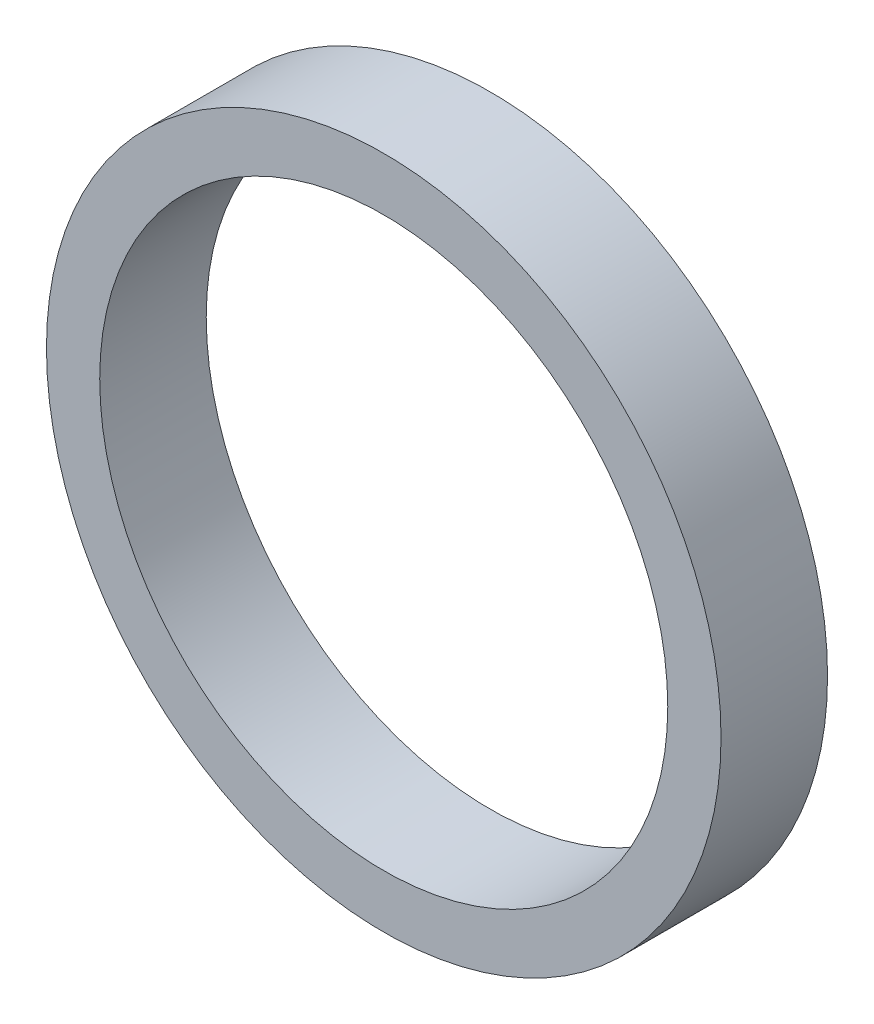
ISO-10303-21;
HEADER;
FILE_DESCRIPTION(('STEP AP214'),'2;1');
FILE_NAME('part.step','',(''),(''),'','','');
FILE_SCHEMA(('AUTOMOTIVE_DESIGN { 1 0 10303 214 1 1 1 1 }'));
ENDSEC;
DATA;
#1=APPLICATION_CONTEXT('core data for automotive mechanical design processes');
#2=APPLICATION_PROTOCOL_DEFINITION('international standard','automotive_design',2000,#1);
#3=PRODUCT_CONTEXT('',#1,'mechanical');
#4=PRODUCT('Part','Part','',(#3));
#5=PRODUCT_RELATED_PRODUCT_CATEGORY('part','',(#4));
#6=PRODUCT_DEFINITION_FORMATION('','',#4);
#7=PRODUCT_DEFINITION_CONTEXT('part definition',#1,'design');
#8=PRODUCT_DEFINITION('design','',#6,#7);
#9=PRODUCT_DEFINITION_SHAPE('','',#8);
#10=(LENGTH_UNIT() NAMED_UNIT(*) SI_UNIT(.MILLI.,.METRE.));
#11=(NAMED_UNIT(*) PLANE_ANGLE_UNIT() SI_UNIT($,.RADIAN.));
#12=(NAMED_UNIT(*) SI_UNIT($,.STERADIAN.) SOLID_ANGLE_UNIT());
#13=UNCERTAINTY_MEASURE_WITH_UNIT(LENGTH_MEASURE(1.E-05),#10,'distance_accuracy_value','');
#14=(GEOMETRIC_REPRESENTATION_CONTEXT(3) GLOBAL_UNCERTAINTY_ASSIGNED_CONTEXT((#13)) GLOBAL_UNIT_ASSIGNED_CONTEXT((#10,
#11,#12)) REPRESENTATION_CONTEXT('',''));
#15=CARTESIAN_POINT('',(0.,0.,0.));
#16=DIRECTION('',(0.,0.,1.));
#17=DIRECTION('',(1.,0.,0.));
#18=AXIS2_PLACEMENT_3D('',#15,#16,#17);
#19=CARTESIAN_POINT('',(0.,0.,3.));
#20=DIRECTION('',(0.,0.,1.));
#21=DIRECTION('',(1.,0.,0.));
#22=AXIS2_PLACEMENT_3D('',#19,#20,#21);
#23=PLANE('',#22);
#24=CARTESIAN_POINT('',(0.,0.,3.));
#25=DIRECTION('',(0.,0.,1.));
#26=DIRECTION('',(1.,0.,0.));
#27=AXIS2_PLACEMENT_3D('',#24,#25,#26);
#28=CIRCLE('',#27,9.5);
#29=CARTESIAN_POINT('',(9.5,0.,3.));
#30=VERTEX_POINT('',#29);
#31=EDGE_CURVE('E10',#30,#30,#28,.T.);
#32=ORIENTED_EDGE('',*,*,#31,.T.);
#33=EDGE_LOOP('',(#32));
#34=FACE_BOUND('',#33,.T.);
#35=CARTESIAN_POINT('',(0.,0.,3.));
#36=DIRECTION('',(0.,0.,1.));
#37=DIRECTION('',(1.,0.,0.));
#38=AXIS2_PLACEMENT_3D('',#35,#36,#37);
#39=CIRCLE('',#38,8.);
#40=CARTESIAN_POINT('',(8.,0.,3.));
#41=VERTEX_POINT('',#40);
#42=EDGE_CURVE('E41',#41,#41,#39,.T.);
#43=ORIENTED_EDGE('',*,*,#42,.F.);
#44=EDGE_LOOP('',(#43));
#45=FACE_BOUND('',#44,.T.);
#46=ADVANCED_FACE('F30',(#34,#45),#23,.T.);
#47=CARTESIAN_POINT('',(0.,0.,0.));
#48=DIRECTION('',(0.,0.,1.));
#49=DIRECTION('',(1.,0.,0.));
#50=AXIS2_PLACEMENT_3D('',#47,#48,#49);
#51=PLANE('',#50);
#52=CARTESIAN_POINT('',(0.,0.,0.));
#53=DIRECTION('',(0.,0.,1.));
#54=DIRECTION('',(1.,0.,0.));
#55=AXIS2_PLACEMENT_3D('',#52,#53,#54);
#56=CIRCLE('',#55,9.5);
#57=CARTESIAN_POINT('',(9.5,0.,0.));
#58=VERTEX_POINT('',#57);
#59=EDGE_CURVE('E34',#58,#58,#56,.T.);
#60=ORIENTED_EDGE('',*,*,#59,.F.);
#61=EDGE_LOOP('',(#60));
#62=FACE_BOUND('',#61,.T.);
#63=CARTESIAN_POINT('',(0.,0.,0.));
#64=DIRECTION('',(0.,0.,1.));
#65=DIRECTION('',(1.,0.,0.));
#66=AXIS2_PLACEMENT_3D('',#63,#64,#65);
#67=CIRCLE('',#66,8.);
#68=CARTESIAN_POINT('',(8.,0.,0.));
#69=VERTEX_POINT('',#68);
#70=EDGE_CURVE('E43',#69,#69,#67,.T.);
#71=ORIENTED_EDGE('',*,*,#70,.T.);
#72=EDGE_LOOP('',(#71));
#73=FACE_BOUND('',#72,.T.);
#74=ADVANCED_FACE('F53',(#62,#73),#51,.F.);
#75=CARTESIAN_POINT('',(0.,0.,3.));
#76=DIRECTION('',(0.,0.,-1.));
#77=DIRECTION('',(-1.,0.,0.));
#78=AXIS2_PLACEMENT_3D('',#75,#76,#77);
#79=CYLINDRICAL_SURFACE('',#78,9.5);
#80=ORIENTED_EDGE('',*,*,#31,.F.);
#81=EDGE_LOOP('',(#80));
#82=FACE_BOUND('',#81,.T.);
#83=ORIENTED_EDGE('',*,*,#59,.T.);
#84=EDGE_LOOP('',(#83));
#85=FACE_BOUND('',#84,.T.);
#86=ADVANCED_FACE('F32',(#82,#85),#79,.T.);
#87=CARTESIAN_POINT('',(0.,0.,3.));
#88=DIRECTION('',(0.,0.,-1.));
#89=DIRECTION('',(-1.,0.,0.));
#90=AXIS2_PLACEMENT_3D('',#87,#88,#89);
#91=CYLINDRICAL_SURFACE('',#90,8.);
#92=ORIENTED_EDGE('',*,*,#42,.T.);
#93=EDGE_LOOP('',(#92));
#94=FACE_BOUND('',#93,.T.);
#95=ORIENTED_EDGE('',*,*,#70,.F.);
#96=EDGE_LOOP('',(#95));
#97=FACE_BOUND('',#96,.T.);
#98=ADVANCED_FACE('F49',(#94,#97),#91,.F.);
#99=CLOSED_SHELL('',(#46,#74,#86,#98));
#100=MANIFOLD_SOLID_BREP('B2',#99);
#101=ADVANCED_BREP_SHAPE_REPRESENTATION('',(#18,#100),#14);
#102=SHAPE_DEFINITION_REPRESENTATION(#9,#101);
ENDSEC;
END-ISO-10303-21;
